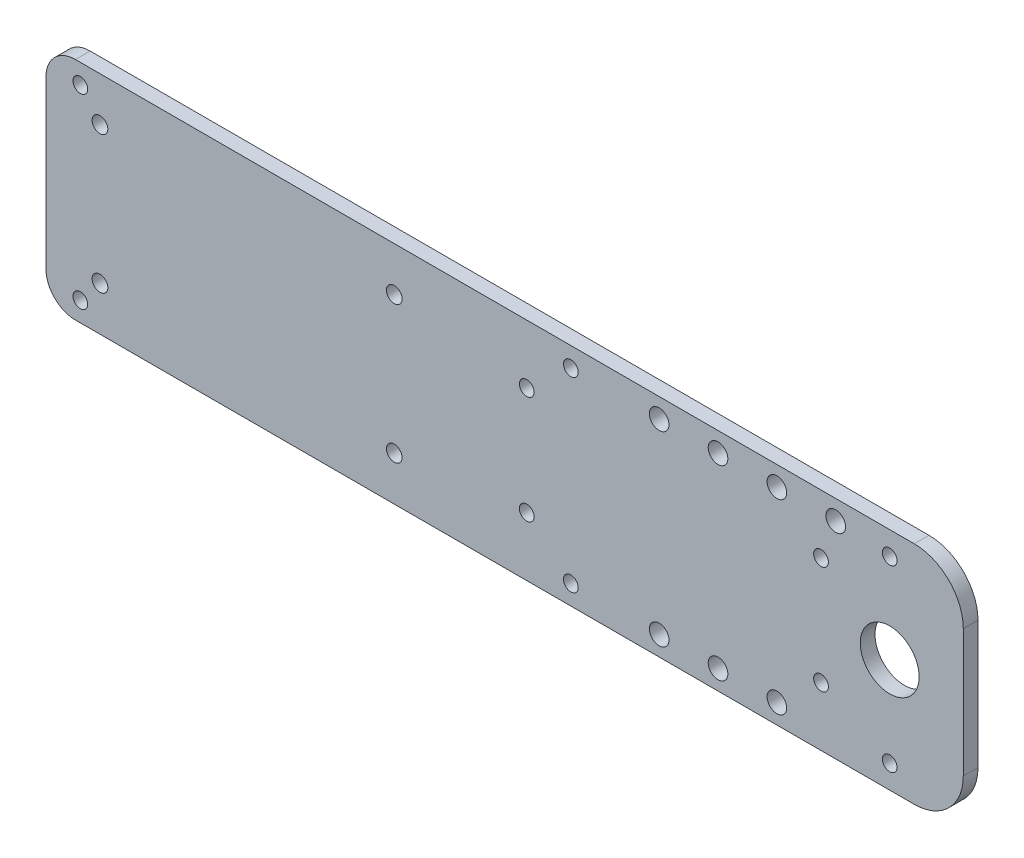
ISO-10303-21;
HEADER;
FILE_DESCRIPTION(('STEP AP214'),'2;1');
FILE_NAME('part.step','',(''),(''),'','','');
FILE_SCHEMA(('AUTOMOTIVE_DESIGN { 1 0 10303 214 1 1 1 1 }'));
ENDSEC;
DATA;
#1=APPLICATION_CONTEXT('core data for automotive mechanical design processes');
#2=APPLICATION_PROTOCOL_DEFINITION('international standard','automotive_design',2000,#1);
#3=PRODUCT_CONTEXT('',#1,'mechanical');
#4=PRODUCT('Part','Part','',(#3));
#5=PRODUCT_RELATED_PRODUCT_CATEGORY('part','',(#4));
#6=PRODUCT_DEFINITION_FORMATION('','',#4);
#7=PRODUCT_DEFINITION_CONTEXT('part definition',#1,'design');
#8=PRODUCT_DEFINITION('design','',#6,#7);
#9=PRODUCT_DEFINITION_SHAPE('','',#8);
#10=(LENGTH_UNIT() NAMED_UNIT(*) SI_UNIT(.MILLI.,.METRE.));
#11=(NAMED_UNIT(*) PLANE_ANGLE_UNIT() SI_UNIT($,.RADIAN.));
#12=(NAMED_UNIT(*) SI_UNIT($,.STERADIAN.) SOLID_ANGLE_UNIT());
#13=UNCERTAINTY_MEASURE_WITH_UNIT(LENGTH_MEASURE(1.E-05),#10,'distance_accuracy_value','');
#14=(GEOMETRIC_REPRESENTATION_CONTEXT(3) GLOBAL_UNCERTAINTY_ASSIGNED_CONTEXT((#13)) GLOBAL_UNIT_ASSIGNED_CONTEXT((#10,
#11,#12)) REPRESENTATION_CONTEXT('',''));
#15=CARTESIAN_POINT('',(0.,0.,0.));
#16=DIRECTION('',(0.,0.,1.));
#17=DIRECTION('',(1.,0.,0.));
#18=AXIS2_PLACEMENT_3D('',#15,#16,#17);
#19=CARTESIAN_POINT('',(0.,0.,3.));
#20=DIRECTION('',(0.,0.,1.));
#21=DIRECTION('',(1.,0.,0.));
#22=AXIS2_PLACEMENT_3D('',#19,#20,#21);
#23=PLANE('',#22);
#24=CARTESIAN_POINT('',(102.,11.,3.));
#25=DIRECTION('',(0.,0.,1.));
#26=DIRECTION('',(1.,0.,0.));
#27=AXIS2_PLACEMENT_3D('',#24,#25,#26);
#28=CIRCLE('',#27,1.5);
#29=CARTESIAN_POINT('',(103.5,11.,3.));
#30=VERTEX_POINT('',#29);
#31=EDGE_CURVE('E332',#30,#30,#28,.F.);
#32=ORIENTED_EDGE('',*,*,#31,.T.);
#33=EDGE_LOOP('',(#32));
#34=FACE_BOUND('',#33,.T.);
#35=CARTESIAN_POINT('',(69.,19.,3.));
#36=DIRECTION('',(0.,0.,1.));
#37=DIRECTION('',(1.,0.,0.));
#38=AXIS2_PLACEMENT_3D('',#35,#36,#37);
#39=CIRCLE('',#38,2.);
#40=CARTESIAN_POINT('',(71.,19.,3.));
#41=VERTEX_POINT('',#40);
#42=EDGE_CURVE('E344',#41,#41,#39,.T.);
#43=ORIENTED_EDGE('',*,*,#42,.F.);
#44=EDGE_LOOP('',(#43));
#45=FACE_BOUND('',#44,.T.);
#46=CARTESIAN_POINT('',(-49.,-19.,3.));
#47=DIRECTION('',(0.,0.,1.));
#48=DIRECTION('',(1.,0.,0.));
#49=AXIS2_PLACEMENT_3D('',#46,#47,#48);
#50=CIRCLE('',#49,1.5);
#51=CARTESIAN_POINT('',(-47.5,-19.,3.));
#52=VERTEX_POINT('',#51);
#53=EDGE_CURVE('E369',#52,#52,#50,.F.);
#54=ORIENTED_EDGE('',*,*,#53,.T.);
#55=EDGE_LOOP('',(#54));
#56=FACE_BOUND('',#55,.T.);
#57=CARTESIAN_POINT('',(69.,-19.,3.));
#58=DIRECTION('',(0.,0.,1.));
#59=DIRECTION('',(1.,0.,0.));
#60=AXIS2_PLACEMENT_3D('',#57,#58,#59);
#61=CIRCLE('',#60,2.);
#62=CARTESIAN_POINT('',(71.,-19.,3.));
#63=VERTEX_POINT('',#62);
#64=EDGE_CURVE('E345',#63,#63,#61,.T.);
#65=ORIENTED_EDGE('',*,*,#64,.F.);
#66=EDGE_LOOP('',(#65));
#67=FACE_BOUND('',#66,.T.);
#68=CARTESIAN_POINT('',(81.,-19.,3.));
#69=DIRECTION('',(0.,0.,1.));
#70=DIRECTION('',(1.,0.,0.));
#71=AXIS2_PLACEMENT_3D('',#68,#69,#70);
#72=CIRCLE('',#71,2.);
#73=CARTESIAN_POINT('',(83.,-19.,3.));
#74=VERTEX_POINT('',#73);
#75=EDGE_CURVE('E351',#74,#74,#72,.T.);
#76=ORIENTED_EDGE('',*,*,#75,.F.);
#77=EDGE_LOOP('',(#76));
#78=FACE_BOUND('',#77,.T.);
#79=CARTESIAN_POINT('',(81.,19.,3.));
#80=DIRECTION('',(0.,0.,1.));
#81=DIRECTION('',(1.,0.,0.));
#82=AXIS2_PLACEMENT_3D('',#79,#80,#81);
#83=CIRCLE('',#82,2.);
#84=CARTESIAN_POINT('',(83.,19.,3.));
#85=VERTEX_POINT('',#84);
#86=EDGE_CURVE('E331',#85,#85,#83,.T.);
#87=ORIENTED_EDGE('',*,*,#86,.F.);
#88=EDGE_LOOP('',(#87));
#89=FACE_BOUND('',#88,.T.);
#90=CARTESIAN_POINT('',(-49.,19.,3.));
#91=DIRECTION('',(0.,0.,1.));
#92=DIRECTION('',(1.,0.,0.));
#93=AXIS2_PLACEMENT_3D('',#90,#91,#92);
#94=CIRCLE('',#93,1.5);
#95=CARTESIAN_POINT('',(-47.5,19.,3.));
#96=VERTEX_POINT('',#95);
#97=EDGE_CURVE('E368',#96,#96,#94,.T.);
#98=ORIENTED_EDGE('',*,*,#97,.F.);
#99=EDGE_LOOP('',(#98));
#100=FACE_BOUND('',#99,.T.);
#101=DIRECTION('',(-1.,0.,0.));
#102=VECTOR('',#101,1.);
#103=CARTESIAN_POINT('',(0.,-23.,3.));
#104=LINE('',#103,#102);
#105=CARTESIAN_POINT('',(121.,-23.,3.));
#106=VERTEX_POINT('',#105);
#107=CARTESIAN_POINT('',(-50.,-23.,3.));
#108=VERTEX_POINT('',#107);
#109=EDGE_CURVE('E138',#106,#108,#104,.T.);
#110=ORIENTED_EDGE('',*,*,#109,.F.);
#111=CARTESIAN_POINT('',(121.,-13.,3.));
#112=DIRECTION('',(0.,0.,1.));
#113=DIRECTION('',(1.,0.,0.));
#114=AXIS2_PLACEMENT_3D('',#111,#112,#113);
#115=CIRCLE('',#114,10.);
#116=CARTESIAN_POINT('',(131.,-13.,3.));
#117=VERTEX_POINT('',#116);
#118=EDGE_CURVE('E165',#106,#117,#115,.T.);
#119=ORIENTED_EDGE('',*,*,#118,.T.);
#120=DIRECTION('',(0.,1.,0.));
#121=VECTOR('',#120,1.);
#122=CARTESIAN_POINT('',(131.,0.,3.));
#123=LINE('',#122,#121);
#124=CARTESIAN_POINT('',(131.,13.,3.));
#125=VERTEX_POINT('',#124);
#126=EDGE_CURVE('E179',#117,#125,#123,.T.);
#127=ORIENTED_EDGE('',*,*,#126,.T.);
#128=CARTESIAN_POINT('',(121.,13.,3.));
#129=DIRECTION('',(0.,0.,1.));
#130=DIRECTION('',(1.,0.,0.));
#131=AXIS2_PLACEMENT_3D('',#128,#129,#130);
#132=CIRCLE('',#131,10.);
#133=CARTESIAN_POINT('',(121.,23.,3.));
#134=VERTEX_POINT('',#133);
#135=EDGE_CURVE('E163',#125,#134,#132,.T.);
#136=ORIENTED_EDGE('',*,*,#135,.T.);
#137=DIRECTION('',(-1.,0.,0.));
#138=VECTOR('',#137,1.);
#139=CARTESIAN_POINT('',(0.,23.,3.));
#140=LINE('',#139,#138);
#141=CARTESIAN_POINT('',(-50.,23.,3.));
#142=VERTEX_POINT('',#141);
#143=EDGE_CURVE('E188',#134,#142,#140,.T.);
#144=ORIENTED_EDGE('',*,*,#143,.T.);
#145=CARTESIAN_POINT('',(-50.,17.,3.));
#146=DIRECTION('',(0.,0.,1.));
#147=DIRECTION('',(1.,0.,0.));
#148=AXIS2_PLACEMENT_3D('',#145,#146,#147);
#149=CIRCLE('',#148,6.);
#150=CARTESIAN_POINT('',(-56.,17.,3.));
#151=VERTEX_POINT('',#150);
#152=EDGE_CURVE('E154',#142,#151,#149,.T.);
#153=ORIENTED_EDGE('',*,*,#152,.T.);
#154=DIRECTION('',(0.,1.,0.));
#155=VECTOR('',#154,1.);
#156=CARTESIAN_POINT('',(-56.,0.,3.));
#157=LINE('',#156,#155);
#158=CARTESIAN_POINT('',(-56.,-17.,3.));
#159=VERTEX_POINT('',#158);
#160=EDGE_CURVE('E190',#159,#151,#157,.T.);
#161=ORIENTED_EDGE('',*,*,#160,.F.);
#162=CARTESIAN_POINT('',(-50.,-17.,3.));
#163=DIRECTION('',(0.,0.,1.));
#164=DIRECTION('',(1.,0.,0.));
#165=AXIS2_PLACEMENT_3D('',#162,#163,#164);
#166=CIRCLE('',#165,6.);
#167=EDGE_CURVE('E156',#159,#108,#166,.T.);
#168=ORIENTED_EDGE('',*,*,#167,.T.);
#169=EDGE_LOOP('',(#110,#119,#127,#136,#144,#153,#161,#168));
#170=FACE_BOUND('',#169,.T.);
#171=CARTESIAN_POINT('',(42.,11.,3.));
#172=DIRECTION('',(0.,0.,1.));
#173=DIRECTION('',(1.,0.,0.));
#174=AXIS2_PLACEMENT_3D('',#171,#172,#173);
#175=CIRCLE('',#174,1.50000000000001);
#176=CARTESIAN_POINT('',(43.5,11.,3.));
#177=VERTEX_POINT('',#176);
#178=EDGE_CURVE('E199',#177,#177,#175,.F.);
#179=ORIENTED_EDGE('',*,*,#178,.T.);
#180=EDGE_LOOP('',(#179));
#181=FACE_BOUND('',#180,.T.);
#182=CARTESIAN_POINT('',(15.,-14.,3.));
#183=DIRECTION('',(0.,0.,1.));
#184=DIRECTION('',(1.,0.,0.));
#185=AXIS2_PLACEMENT_3D('',#182,#183,#184);
#186=CIRCLE('',#185,1.6);
#187=CARTESIAN_POINT('',(16.6,-14.,3.));
#188=VERTEX_POINT('',#187);
#189=EDGE_CURVE('E202',#188,#188,#186,.T.);
#190=ORIENTED_EDGE('',*,*,#189,.F.);
#191=EDGE_LOOP('',(#190));
#192=FACE_BOUND('',#191,.T.);
#193=CARTESIAN_POINT('',(42.,-11.,3.));
#194=DIRECTION('',(0.,0.,1.));
#195=DIRECTION('',(1.,0.,0.));
#196=AXIS2_PLACEMENT_3D('',#193,#194,#195);
#197=CIRCLE('',#196,1.49999999999999);
#198=CARTESIAN_POINT('',(43.5,-11.,3.));
#199=VERTEX_POINT('',#198);
#200=EDGE_CURVE('E205',#199,#199,#197,.T.);
#201=ORIENTED_EDGE('',*,*,#200,.F.);
#202=EDGE_LOOP('',(#201));
#203=FACE_BOUND('',#202,.T.);
#204=CARTESIAN_POINT('',(-45.,14.,3.));
#205=DIRECTION('',(0.,0.,1.));
#206=DIRECTION('',(1.,0.,0.));
#207=AXIS2_PLACEMENT_3D('',#204,#205,#206);
#208=CIRCLE('',#207,1.6);
#209=CARTESIAN_POINT('',(-43.4,14.,3.));
#210=VERTEX_POINT('',#209);
#211=EDGE_CURVE('E208',#210,#210,#208,.T.);
#212=ORIENTED_EDGE('',*,*,#211,.F.);
#213=EDGE_LOOP('',(#212));
#214=FACE_BOUND('',#213,.T.);
#215=CARTESIAN_POINT('',(-45.,-14.,3.));
#216=DIRECTION('',(0.,0.,1.));
#217=DIRECTION('',(1.,0.,0.));
#218=AXIS2_PLACEMENT_3D('',#215,#216,#217);
#219=CIRCLE('',#218,1.6);
#220=CARTESIAN_POINT('',(-43.4,-14.,3.));
#221=VERTEX_POINT('',#220);
#222=EDGE_CURVE('E145',#221,#221,#219,.F.);
#223=ORIENTED_EDGE('',*,*,#222,.T.);
#224=EDGE_LOOP('',(#223));
#225=FACE_BOUND('',#224,.T.);
#226=CARTESIAN_POINT('',(15.,14.,3.));
#227=DIRECTION('',(0.,0.,1.));
#228=DIRECTION('',(1.,0.,0.));
#229=AXIS2_PLACEMENT_3D('',#226,#227,#228);
#230=CIRCLE('',#229,1.6);
#231=CARTESIAN_POINT('',(16.6,14.,3.));
#232=VERTEX_POINT('',#231);
#233=EDGE_CURVE('E140',#232,#232,#230,.F.);
#234=ORIENTED_EDGE('',*,*,#233,.T.);
#235=EDGE_LOOP('',(#234));
#236=FACE_BOUND('',#235,.T.);
#237=CARTESIAN_POINT('',(116.,-18.25,3.));
#238=DIRECTION('',(0.,0.,1.));
#239=DIRECTION('',(1.,0.,0.));
#240=AXIS2_PLACEMENT_3D('',#237,#238,#239);
#241=CIRCLE('',#240,1.5);
#242=CARTESIAN_POINT('',(117.5,-18.25,3.));
#243=VERTEX_POINT('',#242);
#244=EDGE_CURVE('E299',#243,#243,#241,.T.);
#245=ORIENTED_EDGE('',*,*,#244,.F.);
#246=EDGE_LOOP('',(#245));
#247=FACE_BOUND('',#246,.T.);
#248=CARTESIAN_POINT('',(116.,0.,3.));
#249=DIRECTION('',(0.,0.,1.));
#250=DIRECTION('',(1.,0.,0.));
#251=AXIS2_PLACEMENT_3D('',#248,#249,#250);
#252=CIRCLE('',#251,6.);
#253=CARTESIAN_POINT('',(122.,0.,3.));
#254=VERTEX_POINT('',#253);
#255=EDGE_CURVE('E303',#254,#254,#252,.T.);
#256=ORIENTED_EDGE('',*,*,#255,.F.);
#257=EDGE_LOOP('',(#256));
#258=FACE_BOUND('',#257,.T.);
#259=CARTESIAN_POINT('',(93.,-19.,3.));
#260=DIRECTION('',(0.,0.,1.));
#261=DIRECTION('',(1.,0.,0.));
#262=AXIS2_PLACEMENT_3D('',#259,#260,#261);
#263=CIRCLE('',#262,2.);
#264=CARTESIAN_POINT('',(95.,-19.,3.));
#265=VERTEX_POINT('',#264);
#266=EDGE_CURVE('E307',#265,#265,#263,.T.);
#267=ORIENTED_EDGE('',*,*,#266,.F.);
#268=EDGE_LOOP('',(#267));
#269=FACE_BOUND('',#268,.T.);
#270=CARTESIAN_POINT('',(105.,19.,3.));
#271=DIRECTION('',(0.,0.,1.));
#272=DIRECTION('',(1.,0.,0.));
#273=AXIS2_PLACEMENT_3D('',#270,#271,#272);
#274=CIRCLE('',#273,2.);
#275=CARTESIAN_POINT('',(107.,19.,3.));
#276=VERTEX_POINT('',#275);
#277=EDGE_CURVE('E311',#276,#276,#274,.T.);
#278=ORIENTED_EDGE('',*,*,#277,.F.);
#279=EDGE_LOOP('',(#278));
#280=FACE_BOUND('',#279,.T.);
#281=CARTESIAN_POINT('',(93.,19.,3.));
#282=DIRECTION('',(0.,0.,1.));
#283=DIRECTION('',(1.,0.,0.));
#284=AXIS2_PLACEMENT_3D('',#281,#282,#283);
#285=CIRCLE('',#284,2.);
#286=CARTESIAN_POINT('',(95.,19.,3.));
#287=VERTEX_POINT('',#286);
#288=EDGE_CURVE('E315',#287,#287,#285,.F.);
#289=ORIENTED_EDGE('',*,*,#288,.T.);
#290=EDGE_LOOP('',(#289));
#291=FACE_BOUND('',#290,.T.);
#292=CARTESIAN_POINT('',(116.,18.25,3.));
#293=DIRECTION('',(0.,0.,1.));
#294=DIRECTION('',(1.,0.,0.));
#295=AXIS2_PLACEMENT_3D('',#292,#293,#294);
#296=CIRCLE('',#295,1.50000000000001);
#297=CARTESIAN_POINT('',(117.5,18.25,3.));
#298=VERTEX_POINT('',#297);
#299=EDGE_CURVE('E182',#298,#298,#296,.F.);
#300=ORIENTED_EDGE('',*,*,#299,.T.);
#301=EDGE_LOOP('',(#300));
#302=FACE_BOUND('',#301,.T.);
#303=CARTESIAN_POINT('',(51.,19.,3.));
#304=DIRECTION('',(0.,0.,1.));
#305=DIRECTION('',(1.,0.,0.));
#306=AXIS2_PLACEMENT_3D('',#303,#304,#305);
#307=CIRCLE('',#306,1.5);
#308=CARTESIAN_POINT('',(52.5,19.,3.));
#309=VERTEX_POINT('',#308);
#310=EDGE_CURVE('E322',#309,#309,#307,.T.);
#311=ORIENTED_EDGE('',*,*,#310,.F.);
#312=EDGE_LOOP('',(#311));
#313=FACE_BOUND('',#312,.T.);
#314=CARTESIAN_POINT('',(51.,-19.,3.));
#315=DIRECTION('',(0.,0.,1.));
#316=DIRECTION('',(1.,0.,0.));
#317=AXIS2_PLACEMENT_3D('',#314,#315,#316);
#318=CIRCLE('',#317,1.5);
#319=CARTESIAN_POINT('',(52.5,-19.,3.));
#320=VERTEX_POINT('',#319);
#321=EDGE_CURVE('E326',#320,#320,#318,.F.);
#322=ORIENTED_EDGE('',*,*,#321,.T.);
#323=EDGE_LOOP('',(#322));
#324=FACE_BOUND('',#323,.T.);
#325=CARTESIAN_POINT('',(102.,-11.,3.));
#326=DIRECTION('',(0.,0.,1.));
#327=DIRECTION('',(1.,0.,0.));
#328=AXIS2_PLACEMENT_3D('',#325,#326,#327);
#329=CIRCLE('',#328,1.5);
#330=CARTESIAN_POINT('',(103.5,-11.,3.));
#331=VERTEX_POINT('',#330);
#332=EDGE_CURVE('E329',#331,#331,#329,.T.);
#333=ORIENTED_EDGE('',*,*,#332,.F.);
#334=EDGE_LOOP('',(#333));
#335=FACE_BOUND('',#334,.T.);
#336=ADVANCED_FACE('F48',(#34,#45,#56,#67,#78,#89,#100,#170,#181,#192,#203,#214,#225,#236,#247,
#258,#269,#280,#291,#302,#313,#324,#335),#23,.T.);
#337=CARTESIAN_POINT('',(0.,0.,0.));
#338=DIRECTION('',(0.,0.,1.));
#339=DIRECTION('',(1.,0.,0.));
#340=AXIS2_PLACEMENT_3D('',#337,#338,#339);
#341=PLANE('',#340);
#342=CARTESIAN_POINT('',(51.,-19.,0.));
#343=DIRECTION('',(0.,0.,1.));
#344=DIRECTION('',(1.,0.,0.));
#345=AXIS2_PLACEMENT_3D('',#342,#343,#344);
#346=CIRCLE('',#345,1.5);
#347=CARTESIAN_POINT('',(52.5,-19.,0.));
#348=VERTEX_POINT('',#347);
#349=EDGE_CURVE('E356',#348,#348,#346,.F.);
#350=ORIENTED_EDGE('',*,*,#349,.F.);
#351=EDGE_LOOP('',(#350));
#352=FACE_BOUND('',#351,.T.);
#353=CARTESIAN_POINT('',(-49.,-19.,0.));
#354=DIRECTION('',(0.,0.,1.));
#355=DIRECTION('',(1.,0.,0.));
#356=AXIS2_PLACEMENT_3D('',#353,#354,#355);
#357=CIRCLE('',#356,1.5);
#358=CARTESIAN_POINT('',(-47.5,-19.,0.));
#359=VERTEX_POINT('',#358);
#360=EDGE_CURVE('E365',#359,#359,#357,.F.);
#361=ORIENTED_EDGE('',*,*,#360,.F.);
#362=EDGE_LOOP('',(#361));
#363=FACE_BOUND('',#362,.T.);
#364=CARTESIAN_POINT('',(116.,18.25,0.));
#365=DIRECTION('',(0.,0.,1.));
#366=DIRECTION('',(1.,0.,0.));
#367=AXIS2_PLACEMENT_3D('',#364,#365,#366);
#368=CIRCLE('',#367,1.50000000000001);
#369=CARTESIAN_POINT('',(117.5,18.25,0.));
#370=VERTEX_POINT('',#369);
#371=EDGE_CURVE('E124',#370,#370,#368,.F.);
#372=ORIENTED_EDGE('',*,*,#371,.F.);
#373=EDGE_LOOP('',(#372));
#374=FACE_BOUND('',#373,.T.);
#375=CARTESIAN_POINT('',(93.,19.,0.));
#376=DIRECTION('',(0.,0.,1.));
#377=DIRECTION('',(1.,0.,0.));
#378=AXIS2_PLACEMENT_3D('',#375,#376,#377);
#379=CIRCLE('',#378,2.);
#380=CARTESIAN_POINT('',(95.,19.,0.));
#381=VERTEX_POINT('',#380);
#382=EDGE_CURVE('E392',#381,#381,#379,.F.);
#383=ORIENTED_EDGE('',*,*,#382,.F.);
#384=EDGE_LOOP('',(#383));
#385=FACE_BOUND('',#384,.T.);
#386=CARTESIAN_POINT('',(105.,19.,0.));
#387=DIRECTION('',(0.,0.,1.));
#388=DIRECTION('',(1.,0.,0.));
#389=AXIS2_PLACEMENT_3D('',#386,#387,#388);
#390=CIRCLE('',#389,2.);
#391=CARTESIAN_POINT('',(107.,19.,0.));
#392=VERTEX_POINT('',#391);
#393=EDGE_CURVE('E389',#392,#392,#390,.T.);
#394=ORIENTED_EDGE('',*,*,#393,.T.);
#395=EDGE_LOOP('',(#394));
#396=FACE_BOUND('',#395,.T.);
#397=CARTESIAN_POINT('',(93.,-19.,0.));
#398=DIRECTION('',(0.,0.,1.));
#399=DIRECTION('',(1.,0.,0.));
#400=AXIS2_PLACEMENT_3D('',#397,#398,#399);
#401=CIRCLE('',#400,2.);
#402=CARTESIAN_POINT('',(95.,-19.,0.));
#403=VERTEX_POINT('',#402);
#404=EDGE_CURVE('E386',#403,#403,#401,.T.);
#405=ORIENTED_EDGE('',*,*,#404,.T.);
#406=EDGE_LOOP('',(#405));
#407=FACE_BOUND('',#406,.T.);
#408=CARTESIAN_POINT('',(116.,0.,0.));
#409=DIRECTION('',(0.,0.,1.));
#410=DIRECTION('',(1.,0.,0.));
#411=AXIS2_PLACEMENT_3D('',#408,#409,#410);
#412=CIRCLE('',#411,6.);
#413=CARTESIAN_POINT('',(122.,0.,0.));
#414=VERTEX_POINT('',#413);
#415=EDGE_CURVE('E383',#414,#414,#412,.T.);
#416=ORIENTED_EDGE('',*,*,#415,.T.);
#417=EDGE_LOOP('',(#416));
#418=FACE_BOUND('',#417,.T.);
#419=CARTESIAN_POINT('',(116.,-18.25,0.));
#420=DIRECTION('',(0.,0.,1.));
#421=DIRECTION('',(1.,0.,0.));
#422=AXIS2_PLACEMENT_3D('',#419,#420,#421);
#423=CIRCLE('',#422,1.5);
#424=CARTESIAN_POINT('',(117.5,-18.25,0.));
#425=VERTEX_POINT('',#424);
#426=EDGE_CURVE('E181',#425,#425,#423,.T.);
#427=ORIENTED_EDGE('',*,*,#426,.T.);
#428=EDGE_LOOP('',(#427));
#429=FACE_BOUND('',#428,.T.);
#430=CARTESIAN_POINT('',(15.,14.,0.));
#431=DIRECTION('',(0.,0.,1.));
#432=DIRECTION('',(1.,0.,0.));
#433=AXIS2_PLACEMENT_3D('',#430,#431,#432);
#434=CIRCLE('',#433,1.6);
#435=CARTESIAN_POINT('',(16.6,14.,0.));
#436=VERTEX_POINT('',#435);
#437=EDGE_CURVE('E148',#436,#436,#434,.F.);
#438=ORIENTED_EDGE('',*,*,#437,.F.);
#439=EDGE_LOOP('',(#438));
#440=FACE_BOUND('',#439,.T.);
#441=CARTESIAN_POINT('',(-45.,-14.,0.));
#442=DIRECTION('',(0.,0.,1.));
#443=DIRECTION('',(1.,0.,0.));
#444=AXIS2_PLACEMENT_3D('',#441,#442,#443);
#445=CIRCLE('',#444,1.6);
#446=CARTESIAN_POINT('',(-43.4,-14.,0.));
#447=VERTEX_POINT('',#446);
#448=EDGE_CURVE('E193',#447,#447,#445,.F.);
#449=ORIENTED_EDGE('',*,*,#448,.F.);
#450=EDGE_LOOP('',(#449));
#451=FACE_BOUND('',#450,.T.);
#452=CARTESIAN_POINT('',(-45.,14.,0.));
#453=DIRECTION('',(0.,0.,1.));
#454=DIRECTION('',(1.,0.,0.));
#455=AXIS2_PLACEMENT_3D('',#452,#453,#454);
#456=CIRCLE('',#455,1.6);
#457=CARTESIAN_POINT('',(-43.4,14.,0.));
#458=VERTEX_POINT('',#457);
#459=EDGE_CURVE('E225',#458,#458,#456,.T.);
#460=ORIENTED_EDGE('',*,*,#459,.T.);
#461=EDGE_LOOP('',(#460));
#462=FACE_BOUND('',#461,.T.);
#463=CARTESIAN_POINT('',(42.,-11.,0.));
#464=DIRECTION('',(0.,0.,1.));
#465=DIRECTION('',(1.,0.,0.));
#466=AXIS2_PLACEMENT_3D('',#463,#464,#465);
#467=CIRCLE('',#466,1.49999999999999);
#468=CARTESIAN_POINT('',(43.5,-11.,0.));
#469=VERTEX_POINT('',#468);
#470=EDGE_CURVE('E222',#469,#469,#467,.T.);
#471=ORIENTED_EDGE('',*,*,#470,.T.);
#472=EDGE_LOOP('',(#471));
#473=FACE_BOUND('',#472,.T.);
#474=CARTESIAN_POINT('',(15.,-14.,0.));
#475=DIRECTION('',(0.,0.,1.));
#476=DIRECTION('',(1.,0.,0.));
#477=AXIS2_PLACEMENT_3D('',#474,#475,#476);
#478=CIRCLE('',#477,1.6);
#479=CARTESIAN_POINT('',(16.6,-14.,0.));
#480=VERTEX_POINT('',#479);
#481=EDGE_CURVE('E219',#480,#480,#478,.T.);
#482=ORIENTED_EDGE('',*,*,#481,.T.);
#483=EDGE_LOOP('',(#482));
#484=FACE_BOUND('',#483,.T.);
#485=CARTESIAN_POINT('',(42.,11.,0.));
#486=DIRECTION('',(0.,0.,1.));
#487=DIRECTION('',(1.,0.,0.));
#488=AXIS2_PLACEMENT_3D('',#485,#486,#487);
#489=CIRCLE('',#488,1.50000000000001);
#490=CARTESIAN_POINT('',(43.5,11.,0.));
#491=VERTEX_POINT('',#490);
#492=EDGE_CURVE('E216',#491,#491,#489,.F.);
#493=ORIENTED_EDGE('',*,*,#492,.F.);
#494=EDGE_LOOP('',(#493));
#495=FACE_BOUND('',#494,.T.);
#496=DIRECTION('',(0.,1.,0.));
#497=VECTOR('',#496,1.);
#498=CARTESIAN_POINT('',(131.,0.,0.));
#499=LINE('',#498,#497);
#500=CARTESIAN_POINT('',(131.,-13.,0.));
#501=VERTEX_POINT('',#500);
#502=CARTESIAN_POINT('',(131.,13.,0.));
#503=VERTEX_POINT('',#502);
#504=EDGE_CURVE('E176',#501,#503,#499,.T.);
#505=ORIENTED_EDGE('',*,*,#504,.F.);
#506=CARTESIAN_POINT('',(121.,-13.,0.));
#507=DIRECTION('',(0.,0.,1.));
#508=DIRECTION('',(1.,0.,0.));
#509=AXIS2_PLACEMENT_3D('',#506,#507,#508);
#510=CIRCLE('',#509,10.);
#511=CARTESIAN_POINT('',(121.,-23.,0.));
#512=VERTEX_POINT('',#511);
#513=EDGE_CURVE('E56',#501,#512,#510,.F.);
#514=ORIENTED_EDGE('',*,*,#513,.T.);
#515=DIRECTION('',(-1.,0.,0.));
#516=VECTOR('',#515,1.);
#517=CARTESIAN_POINT('',(0.,-23.,0.));
#518=LINE('',#517,#516);
#519=CARTESIAN_POINT('',(-50.,-23.,0.));
#520=VERTEX_POINT('',#519);
#521=EDGE_CURVE('E111',#512,#520,#518,.T.);
#522=ORIENTED_EDGE('',*,*,#521,.T.);
#523=CARTESIAN_POINT('',(-50.,-17.,0.));
#524=DIRECTION('',(0.,0.,1.));
#525=DIRECTION('',(1.,0.,0.));
#526=AXIS2_PLACEMENT_3D('',#523,#524,#525);
#527=CIRCLE('',#526,6.);
#528=CARTESIAN_POINT('',(-56.,-17.,0.));
#529=VERTEX_POINT('',#528);
#530=EDGE_CURVE('E116',#520,#529,#527,.F.);
#531=ORIENTED_EDGE('',*,*,#530,.T.);
#532=DIRECTION('',(0.,1.,0.));
#533=VECTOR('',#532,1.);
#534=CARTESIAN_POINT('',(-56.,0.,0.));
#535=LINE('',#534,#533);
#536=CARTESIAN_POINT('',(-56.,17.,0.));
#537=VERTEX_POINT('',#536);
#538=EDGE_CURVE('E214',#529,#537,#535,.T.);
#539=ORIENTED_EDGE('',*,*,#538,.T.);
#540=CARTESIAN_POINT('',(-50.,17.,0.));
#541=DIRECTION('',(0.,0.,1.));
#542=DIRECTION('',(1.,0.,0.));
#543=AXIS2_PLACEMENT_3D('',#540,#541,#542);
#544=CIRCLE('',#543,6.);
#545=CARTESIAN_POINT('',(-50.,23.,0.));
#546=VERTEX_POINT('',#545);
#547=EDGE_CURVE('E134',#537,#546,#544,.F.);
#548=ORIENTED_EDGE('',*,*,#547,.T.);
#549=DIRECTION('',(-1.,0.,0.));
#550=VECTOR('',#549,1.);
#551=CARTESIAN_POINT('',(0.,23.,0.));
#552=LINE('',#551,#550);
#553=CARTESIAN_POINT('',(121.,23.,0.));
#554=VERTEX_POINT('',#553);
#555=EDGE_CURVE('E123',#554,#546,#552,.T.);
#556=ORIENTED_EDGE('',*,*,#555,.F.);
#557=CARTESIAN_POINT('',(121.,13.,0.));
#558=DIRECTION('',(0.,0.,1.));
#559=DIRECTION('',(1.,0.,0.));
#560=AXIS2_PLACEMENT_3D('',#557,#558,#559);
#561=CIRCLE('',#560,10.);
#562=EDGE_CURVE('E68',#554,#503,#561,.F.);
#563=ORIENTED_EDGE('',*,*,#562,.T.);
#564=EDGE_LOOP('',(#505,#514,#522,#531,#539,#548,#556,#563));
#565=FACE_BOUND('',#564,.T.);
#566=CARTESIAN_POINT('',(-49.,19.,0.));
#567=DIRECTION('',(0.,0.,1.));
#568=DIRECTION('',(1.,0.,0.));
#569=AXIS2_PLACEMENT_3D('',#566,#567,#568);
#570=CIRCLE('',#569,1.5);
#571=CARTESIAN_POINT('',(-47.5,19.,0.));
#572=VERTEX_POINT('',#571);
#573=EDGE_CURVE('E376',#572,#572,#570,.T.);
#574=ORIENTED_EDGE('',*,*,#573,.T.);
#575=EDGE_LOOP('',(#574));
#576=FACE_BOUND('',#575,.T.);
#577=CARTESIAN_POINT('',(81.,19.,0.));
#578=DIRECTION('',(0.,0.,1.));
#579=DIRECTION('',(1.,0.,0.));
#580=AXIS2_PLACEMENT_3D('',#577,#578,#579);
#581=CIRCLE('',#580,2.);
#582=CARTESIAN_POINT('',(83.,19.,0.));
#583=VERTEX_POINT('',#582);
#584=EDGE_CURVE('E335',#583,#583,#581,.T.);
#585=ORIENTED_EDGE('',*,*,#584,.T.);
#586=EDGE_LOOP('',(#585));
#587=FACE_BOUND('',#586,.T.);
#588=CARTESIAN_POINT('',(81.,-19.,0.));
#589=DIRECTION('',(0.,0.,1.));
#590=DIRECTION('',(1.,0.,0.));
#591=AXIS2_PLACEMENT_3D('',#588,#589,#590);
#592=CIRCLE('',#591,2.);
#593=CARTESIAN_POINT('',(83.,-19.,0.));
#594=VERTEX_POINT('',#593);
#595=EDGE_CURVE('E348',#594,#594,#592,.T.);
#596=ORIENTED_EDGE('',*,*,#595,.T.);
#597=EDGE_LOOP('',(#596));
#598=FACE_BOUND('',#597,.T.);
#599=CARTESIAN_POINT('',(69.,-19.,0.));
#600=DIRECTION('',(0.,0.,1.));
#601=DIRECTION('',(1.,0.,0.));
#602=AXIS2_PLACEMENT_3D('',#599,#600,#601);
#603=CIRCLE('',#602,2.);
#604=CARTESIAN_POINT('',(71.,-19.,0.));
#605=VERTEX_POINT('',#604);
#606=EDGE_CURVE('E341',#605,#605,#603,.T.);
#607=ORIENTED_EDGE('',*,*,#606,.T.);
#608=EDGE_LOOP('',(#607));
#609=FACE_BOUND('',#608,.T.);
#610=CARTESIAN_POINT('',(51.,19.,0.));
#611=DIRECTION('',(0.,0.,1.));
#612=DIRECTION('',(1.,0.,0.));
#613=AXIS2_PLACEMENT_3D('',#610,#611,#612);
#614=CIRCLE('',#613,1.5);
#615=CARTESIAN_POINT('',(52.5,19.,0.));
#616=VERTEX_POINT('',#615);
#617=EDGE_CURVE('E372',#616,#616,#614,.T.);
#618=ORIENTED_EDGE('',*,*,#617,.T.);
#619=EDGE_LOOP('',(#618));
#620=FACE_BOUND('',#619,.T.);
#621=CARTESIAN_POINT('',(69.,19.,0.));
#622=DIRECTION('',(0.,0.,1.));
#623=DIRECTION('',(1.,0.,0.));
#624=AXIS2_PLACEMENT_3D('',#621,#622,#623);
#625=CIRCLE('',#624,2.);
#626=CARTESIAN_POINT('',(71.,19.,0.));
#627=VERTEX_POINT('',#626);
#628=EDGE_CURVE('E360',#627,#627,#625,.T.);
#629=ORIENTED_EDGE('',*,*,#628,.T.);
#630=EDGE_LOOP('',(#629));
#631=FACE_BOUND('',#630,.T.);
#632=CARTESIAN_POINT('',(102.,11.,0.));
#633=DIRECTION('',(0.,0.,1.));
#634=DIRECTION('',(1.,0.,0.));
#635=AXIS2_PLACEMENT_3D('',#632,#633,#634);
#636=CIRCLE('',#635,1.5);
#637=CARTESIAN_POINT('',(103.5,11.,0.));
#638=VERTEX_POINT('',#637);
#639=EDGE_CURVE('E484',#638,#638,#636,.T.);
#640=ORIENTED_EDGE('',*,*,#639,.T.);
#641=EDGE_LOOP('',(#640));
#642=FACE_BOUND('',#641,.T.);
#643=CARTESIAN_POINT('',(102.,-11.,0.));
#644=DIRECTION('',(0.,0.,-1.));
#645=DIRECTION('',(-1.,0.,0.));
#646=AXIS2_PLACEMENT_3D('',#643,#644,#645);
#647=CIRCLE('',#646,1.5);
#648=CARTESIAN_POINT('',(100.5,-11.,0.));
#649=VERTEX_POINT('',#648);
#650=EDGE_CURVE('E337',#649,#649,#647,.T.);
#651=ORIENTED_EDGE('',*,*,#650,.F.);
#652=EDGE_LOOP('',(#651));
#653=FACE_BOUND('',#652,.T.);
#654=ADVANCED_FACE('F113',(#352,#363,#374,#385,#396,#407,#418,#429,#440,#451,#462,#473,#484,
#495,#565,#576,#587,#598,#609,#620,#631,#642,#653),#341,.F.);
#655=CARTESIAN_POINT('',(0.,-23.,3.));
#656=DIRECTION('',(0.,-1.,0.));
#657=DIRECTION('',(1.,0.,0.));
#658=AXIS2_PLACEMENT_3D('',#655,#656,#657);
#659=PLANE('',#658);
#660=ORIENTED_EDGE('',*,*,#521,.F.);
#661=DIRECTION('',(0.,0.,1.));
#662=VECTOR('',#661,1.);
#663=CARTESIAN_POINT('',(121.,-23.,3.));
#664=LINE('',#663,#662);
#665=EDGE_CURVE('E161',#512,#106,#664,.T.);
#666=ORIENTED_EDGE('',*,*,#665,.T.);
#667=ORIENTED_EDGE('',*,*,#109,.T.);
#668=DIRECTION('',(0.,0.,-1.));
#669=VECTOR('',#668,1.);
#670=CARTESIAN_POINT('',(-50.,-23.,3.));
#671=LINE('',#670,#669);
#672=EDGE_CURVE('E131',#108,#520,#671,.T.);
#673=ORIENTED_EDGE('',*,*,#672,.T.);
#674=EDGE_LOOP('',(#660,#666,#667,#673));
#675=FACE_BOUND('',#674,.T.);
#676=ADVANCED_FACE('F136',(#675),#659,.T.);
#677=CARTESIAN_POINT('',(0.,23.,3.));
#678=DIRECTION('',(0.,-1.,0.));
#679=DIRECTION('',(1.,0.,0.));
#680=AXIS2_PLACEMENT_3D('',#677,#678,#679);
#681=PLANE('',#680);
#682=ORIENTED_EDGE('',*,*,#143,.F.);
#683=DIRECTION('',(0.,0.,1.));
#684=VECTOR('',#683,1.);
#685=CARTESIAN_POINT('',(121.,23.,0.));
#686=LINE('',#685,#684);
#687=EDGE_CURVE('E13',#134,#554,#686,.F.);
#688=ORIENTED_EDGE('',*,*,#687,.T.);
#689=ORIENTED_EDGE('',*,*,#555,.T.);
#690=DIRECTION('',(0.,0.,-1.));
#691=VECTOR('',#690,1.);
#692=CARTESIAN_POINT('',(-50.,23.,3.));
#693=LINE('',#692,#691);
#694=EDGE_CURVE('E158',#546,#142,#693,.F.);
#695=ORIENTED_EDGE('',*,*,#694,.T.);
#696=EDGE_LOOP('',(#682,#688,#689,#695));
#697=FACE_BOUND('',#696,.T.);
#698=ADVANCED_FACE('F277',(#697),#681,.F.);
#699=CARTESIAN_POINT('',(-45.,-14.,3.));
#700=DIRECTION('',(0.,0.,-1.));
#701=DIRECTION('',(-1.,0.,0.));
#702=AXIS2_PLACEMENT_3D('',#699,#700,#701);
#703=CYLINDRICAL_SURFACE('',#702,1.6);
#704=ORIENTED_EDGE('',*,*,#222,.F.);
#705=EDGE_LOOP('',(#704));
#706=FACE_BOUND('',#705,.T.);
#707=ORIENTED_EDGE('',*,*,#448,.T.);
#708=EDGE_LOOP('',(#707));
#709=FACE_BOUND('',#708,.T.);
#710=ADVANCED_FACE('F230',(#706,#709),#703,.F.);
#711=CARTESIAN_POINT('',(-45.,14.,3.));
#712=DIRECTION('',(0.,0.,-1.));
#713=DIRECTION('',(-1.,0.,0.));
#714=AXIS2_PLACEMENT_3D('',#711,#712,#713);
#715=CYLINDRICAL_SURFACE('',#714,1.6);
#716=ORIENTED_EDGE('',*,*,#211,.T.);
#717=EDGE_LOOP('',(#716));
#718=FACE_BOUND('',#717,.T.);
#719=ORIENTED_EDGE('',*,*,#459,.F.);
#720=EDGE_LOOP('',(#719));
#721=FACE_BOUND('',#720,.T.);
#722=ADVANCED_FACE('F276',(#718,#721),#715,.F.);
#723=CARTESIAN_POINT('',(42.,-11.,3.));
#724=DIRECTION('',(0.,0.,-1.));
#725=DIRECTION('',(-1.,0.,0.));
#726=AXIS2_PLACEMENT_3D('',#723,#724,#725);
#727=CYLINDRICAL_SURFACE('',#726,1.49999999999999);
#728=ORIENTED_EDGE('',*,*,#200,.T.);
#729=EDGE_LOOP('',(#728));
#730=FACE_BOUND('',#729,.T.);
#731=ORIENTED_EDGE('',*,*,#470,.F.);
#732=EDGE_LOOP('',(#731));
#733=FACE_BOUND('',#732,.T.);
#734=ADVANCED_FACE('F257',(#730,#733),#727,.F.);
#735=CARTESIAN_POINT('',(15.,-14.,3.));
#736=DIRECTION('',(0.,0.,-1.));
#737=DIRECTION('',(-1.,0.,0.));
#738=AXIS2_PLACEMENT_3D('',#735,#736,#737);
#739=CYLINDRICAL_SURFACE('',#738,1.6);
#740=ORIENTED_EDGE('',*,*,#189,.T.);
#741=EDGE_LOOP('',(#740));
#742=FACE_BOUND('',#741,.T.);
#743=ORIENTED_EDGE('',*,*,#481,.F.);
#744=EDGE_LOOP('',(#743));
#745=FACE_BOUND('',#744,.T.);
#746=ADVANCED_FACE('F247',(#742,#745),#739,.F.);
#747=CARTESIAN_POINT('',(42.,11.,3.));
#748=DIRECTION('',(0.,0.,-1.));
#749=DIRECTION('',(-1.,0.,0.));
#750=AXIS2_PLACEMENT_3D('',#747,#748,#749);
#751=CYLINDRICAL_SURFACE('',#750,1.50000000000001);
#752=ORIENTED_EDGE('',*,*,#178,.F.);
#753=EDGE_LOOP('',(#752));
#754=FACE_BOUND('',#753,.T.);
#755=ORIENTED_EDGE('',*,*,#492,.T.);
#756=EDGE_LOOP('',(#755));
#757=FACE_BOUND('',#756,.T.);
#758=ADVANCED_FACE('F244',(#754,#757),#751,.F.);
#759=CARTESIAN_POINT('',(-56.,0.,3.));
#760=DIRECTION('',(-1.,0.,0.));
#761=DIRECTION('',(0.,-1.,0.));
#762=AXIS2_PLACEMENT_3D('',#759,#760,#761);
#763=PLANE('',#762);
#764=ORIENTED_EDGE('',*,*,#538,.F.);
#765=DIRECTION('',(0.,0.,-1.));
#766=VECTOR('',#765,1.);
#767=CARTESIAN_POINT('',(-56.,-17.,3.));
#768=LINE('',#767,#766);
#769=EDGE_CURVE('E132',#529,#159,#768,.F.);
#770=ORIENTED_EDGE('',*,*,#769,.T.);
#771=ORIENTED_EDGE('',*,*,#160,.T.);
#772=DIRECTION('',(0.,0.,-1.));
#773=VECTOR('',#772,1.);
#774=CARTESIAN_POINT('',(-56.,17.,0.));
#775=LINE('',#774,#773);
#776=EDGE_CURVE('E133',#151,#537,#775,.T.);
#777=ORIENTED_EDGE('',*,*,#776,.T.);
#778=EDGE_LOOP('',(#764,#770,#771,#777));
#779=FACE_BOUND('',#778,.T.);
#780=ADVANCED_FACE('F246',(#779),#763,.T.);
#781=CARTESIAN_POINT('',(15.,14.,3.));
#782=DIRECTION('',(0.,0.,-1.));
#783=DIRECTION('',(-1.,0.,0.));
#784=AXIS2_PLACEMENT_3D('',#781,#782,#783);
#785=CYLINDRICAL_SURFACE('',#784,1.6);
#786=ORIENTED_EDGE('',*,*,#233,.F.);
#787=EDGE_LOOP('',(#786));
#788=FACE_BOUND('',#787,.T.);
#789=ORIENTED_EDGE('',*,*,#437,.T.);
#790=EDGE_LOOP('',(#789));
#791=FACE_BOUND('',#790,.T.);
#792=ADVANCED_FACE('F254',(#788,#791),#785,.F.);
#793=CARTESIAN_POINT('',(-50.,-17.,3.));
#794=DIRECTION('',(0.,0.,-1.));
#795=DIRECTION('',(-1.,0.,0.));
#796=AXIS2_PLACEMENT_3D('',#793,#794,#795);
#797=CYLINDRICAL_SURFACE('',#796,6.);
#798=ORIENTED_EDGE('',*,*,#167,.F.);
#799=ORIENTED_EDGE('',*,*,#769,.F.);
#800=ORIENTED_EDGE('',*,*,#530,.F.);
#801=ORIENTED_EDGE('',*,*,#672,.F.);
#802=EDGE_LOOP('',(#798,#799,#800,#801));
#803=FACE_BOUND('',#802,.T.);
#804=ADVANCED_FACE('F130',(#803),#797,.T.);
#805=CARTESIAN_POINT('',(-50.,17.,3.));
#806=DIRECTION('',(0.,0.,1.));
#807=DIRECTION('',(1.,0.,0.));
#808=AXIS2_PLACEMENT_3D('',#805,#806,#807);
#809=CYLINDRICAL_SURFACE('',#808,6.);
#810=ORIENTED_EDGE('',*,*,#152,.F.);
#811=ORIENTED_EDGE('',*,*,#694,.F.);
#812=ORIENTED_EDGE('',*,*,#547,.F.);
#813=ORIENTED_EDGE('',*,*,#776,.F.);
#814=EDGE_LOOP('',(#810,#811,#812,#813));
#815=FACE_BOUND('',#814,.T.);
#816=ADVANCED_FACE('F577',(#815),#809,.T.);
#817=CARTESIAN_POINT('',(131.,0.,0.));
#818=DIRECTION('',(1.,0.,0.));
#819=DIRECTION('',(0.,0.,-1.));
#820=AXIS2_PLACEMENT_3D('',#817,#818,#819);
#821=PLANE('',#820);
#822=ORIENTED_EDGE('',*,*,#126,.F.);
#823=DIRECTION('',(0.,0.,1.));
#824=VECTOR('',#823,1.);
#825=CARTESIAN_POINT('',(131.,-13.,0.));
#826=LINE('',#825,#824);
#827=EDGE_CURVE('E170',#117,#501,#826,.F.);
#828=ORIENTED_EDGE('',*,*,#827,.T.);
#829=ORIENTED_EDGE('',*,*,#504,.T.);
#830=DIRECTION('',(0.,0.,1.));
#831=VECTOR('',#830,1.);
#832=CARTESIAN_POINT('',(131.,13.,3.));
#833=LINE('',#832,#831);
#834=EDGE_CURVE('E167',#503,#125,#833,.T.);
#835=ORIENTED_EDGE('',*,*,#834,.T.);
#836=EDGE_LOOP('',(#822,#828,#829,#835));
#837=FACE_BOUND('',#836,.T.);
#838=ADVANCED_FACE('F175',(#837),#821,.T.);
#839=CARTESIAN_POINT('',(93.,19.,0.));
#840=DIRECTION('',(0.,0.,1.));
#841=DIRECTION('',(1.,0.,0.));
#842=AXIS2_PLACEMENT_3D('',#839,#840,#841);
#843=CYLINDRICAL_SURFACE('',#842,2.);
#844=ORIENTED_EDGE('',*,*,#382,.T.);
#845=EDGE_LOOP('',(#844));
#846=FACE_BOUND('',#845,.T.);
#847=ORIENTED_EDGE('',*,*,#288,.F.);
#848=EDGE_LOOP('',(#847));
#849=FACE_BOUND('',#848,.T.);
#850=ADVANCED_FACE('F405',(#846,#849),#843,.F.);
#851=CARTESIAN_POINT('',(105.,19.,0.));
#852=DIRECTION('',(0.,0.,1.));
#853=DIRECTION('',(1.,0.,0.));
#854=AXIS2_PLACEMENT_3D('',#851,#852,#853);
#855=CYLINDRICAL_SURFACE('',#854,2.);
#856=ORIENTED_EDGE('',*,*,#393,.F.);
#857=EDGE_LOOP('',(#856));
#858=FACE_BOUND('',#857,.T.);
#859=ORIENTED_EDGE('',*,*,#277,.T.);
#860=EDGE_LOOP('',(#859));
#861=FACE_BOUND('',#860,.T.);
#862=ADVANCED_FACE('F402',(#858,#861),#855,.F.);
#863=CARTESIAN_POINT('',(93.,-19.,0.));
#864=DIRECTION('',(0.,0.,1.));
#865=DIRECTION('',(1.,0.,0.));
#866=AXIS2_PLACEMENT_3D('',#863,#864,#865);
#867=CYLINDRICAL_SURFACE('',#866,2.);
#868=ORIENTED_EDGE('',*,*,#404,.F.);
#869=EDGE_LOOP('',(#868));
#870=FACE_BOUND('',#869,.T.);
#871=ORIENTED_EDGE('',*,*,#266,.T.);
#872=EDGE_LOOP('',(#871));
#873=FACE_BOUND('',#872,.T.);
#874=ADVANCED_FACE('F404',(#870,#873),#867,.F.);
#875=CARTESIAN_POINT('',(116.,0.,0.));
#876=DIRECTION('',(0.,0.,1.));
#877=DIRECTION('',(1.,0.,0.));
#878=AXIS2_PLACEMENT_3D('',#875,#876,#877);
#879=CYLINDRICAL_SURFACE('',#878,6.);
#880=ORIENTED_EDGE('',*,*,#415,.F.);
#881=EDGE_LOOP('',(#880));
#882=FACE_BOUND('',#881,.T.);
#883=ORIENTED_EDGE('',*,*,#255,.T.);
#884=EDGE_LOOP('',(#883));
#885=FACE_BOUND('',#884,.T.);
#886=ADVANCED_FACE('F412',(#882,#885),#879,.F.);
#887=CARTESIAN_POINT('',(116.,-18.25,0.));
#888=DIRECTION('',(0.,0.,1.));
#889=DIRECTION('',(1.,0.,0.));
#890=AXIS2_PLACEMENT_3D('',#887,#888,#889);
#891=CYLINDRICAL_SURFACE('',#890,1.5);
#892=ORIENTED_EDGE('',*,*,#426,.F.);
#893=EDGE_LOOP('',(#892));
#894=FACE_BOUND('',#893,.T.);
#895=ORIENTED_EDGE('',*,*,#244,.T.);
#896=EDGE_LOOP('',(#895));
#897=FACE_BOUND('',#896,.T.);
#898=ADVANCED_FACE('F421',(#894,#897),#891,.F.);
#899=CARTESIAN_POINT('',(116.,18.25,0.));
#900=DIRECTION('',(0.,0.,1.));
#901=DIRECTION('',(1.,0.,0.));
#902=AXIS2_PLACEMENT_3D('',#899,#900,#901);
#903=CYLINDRICAL_SURFACE('',#902,1.50000000000001);
#904=ORIENTED_EDGE('',*,*,#371,.T.);
#905=EDGE_LOOP('',(#904));
#906=FACE_BOUND('',#905,.T.);
#907=ORIENTED_EDGE('',*,*,#299,.F.);
#908=EDGE_LOOP('',(#907));
#909=FACE_BOUND('',#908,.T.);
#910=ADVANCED_FACE('F424',(#906,#909),#903,.F.);
#911=CARTESIAN_POINT('',(-49.,19.,0.));
#912=DIRECTION('',(0.,0.,1.));
#913=DIRECTION('',(1.,0.,0.));
#914=AXIS2_PLACEMENT_3D('',#911,#912,#913);
#915=CYLINDRICAL_SURFACE('',#914,1.5);
#916=ORIENTED_EDGE('',*,*,#573,.F.);
#917=EDGE_LOOP('',(#916));
#918=FACE_BOUND('',#917,.T.);
#919=ORIENTED_EDGE('',*,*,#97,.T.);
#920=EDGE_LOOP('',(#919));
#921=FACE_BOUND('',#920,.T.);
#922=ADVANCED_FACE('F429',(#918,#921),#915,.F.);
#923=CARTESIAN_POINT('',(81.,19.,0.));
#924=DIRECTION('',(0.,0.,1.));
#925=DIRECTION('',(1.,0.,0.));
#926=AXIS2_PLACEMENT_3D('',#923,#924,#925);
#927=CYLINDRICAL_SURFACE('',#926,2.);
#928=ORIENTED_EDGE('',*,*,#584,.F.);
#929=EDGE_LOOP('',(#928));
#930=FACE_BOUND('',#929,.T.);
#931=ORIENTED_EDGE('',*,*,#86,.T.);
#932=EDGE_LOOP('',(#931));
#933=FACE_BOUND('',#932,.T.);
#934=ADVANCED_FACE('F440',(#930,#933),#927,.F.);
#935=CARTESIAN_POINT('',(81.,-19.,0.));
#936=DIRECTION('',(0.,0.,1.));
#937=DIRECTION('',(1.,0.,0.));
#938=AXIS2_PLACEMENT_3D('',#935,#936,#937);
#939=CYLINDRICAL_SURFACE('',#938,2.);
#940=ORIENTED_EDGE('',*,*,#595,.F.);
#941=EDGE_LOOP('',(#940));
#942=FACE_BOUND('',#941,.T.);
#943=ORIENTED_EDGE('',*,*,#75,.T.);
#944=EDGE_LOOP('',(#943));
#945=FACE_BOUND('',#944,.T.);
#946=ADVANCED_FACE('F464',(#942,#945),#939,.F.);
#947=CARTESIAN_POINT('',(69.,-19.,0.));
#948=DIRECTION('',(0.,0.,1.));
#949=DIRECTION('',(1.,0.,0.));
#950=AXIS2_PLACEMENT_3D('',#947,#948,#949);
#951=CYLINDRICAL_SURFACE('',#950,2.);
#952=ORIENTED_EDGE('',*,*,#606,.F.);
#953=EDGE_LOOP('',(#952));
#954=FACE_BOUND('',#953,.T.);
#955=ORIENTED_EDGE('',*,*,#64,.T.);
#956=EDGE_LOOP('',(#955));
#957=FACE_BOUND('',#956,.T.);
#958=ADVANCED_FACE('F453',(#954,#957),#951,.F.);
#959=CARTESIAN_POINT('',(-49.,-19.,0.));
#960=DIRECTION('',(0.,0.,1.));
#961=DIRECTION('',(1.,0.,0.));
#962=AXIS2_PLACEMENT_3D('',#959,#960,#961);
#963=CYLINDRICAL_SURFACE('',#962,1.5);
#964=ORIENTED_EDGE('',*,*,#360,.T.);
#965=EDGE_LOOP('',(#964));
#966=FACE_BOUND('',#965,.T.);
#967=ORIENTED_EDGE('',*,*,#53,.F.);
#968=EDGE_LOOP('',(#967));
#969=FACE_BOUND('',#968,.T.);
#970=ADVANCED_FACE('F449',(#966,#969),#963,.F.);
#971=CARTESIAN_POINT('',(51.,19.,0.));
#972=DIRECTION('',(0.,0.,1.));
#973=DIRECTION('',(1.,0.,0.));
#974=AXIS2_PLACEMENT_3D('',#971,#972,#973);
#975=CYLINDRICAL_SURFACE('',#974,1.5);
#976=ORIENTED_EDGE('',*,*,#617,.F.);
#977=EDGE_LOOP('',(#976));
#978=FACE_BOUND('',#977,.T.);
#979=ORIENTED_EDGE('',*,*,#310,.T.);
#980=EDGE_LOOP('',(#979));
#981=FACE_BOUND('',#980,.T.);
#982=ADVANCED_FACE('F445',(#978,#981),#975,.F.);
#983=CARTESIAN_POINT('',(51.,-19.,0.));
#984=DIRECTION('',(0.,0.,1.));
#985=DIRECTION('',(1.,0.,0.));
#986=AXIS2_PLACEMENT_3D('',#983,#984,#985);
#987=CYLINDRICAL_SURFACE('',#986,1.5);
#988=ORIENTED_EDGE('',*,*,#349,.T.);
#989=EDGE_LOOP('',(#988));
#990=FACE_BOUND('',#989,.T.);
#991=ORIENTED_EDGE('',*,*,#321,.F.);
#992=EDGE_LOOP('',(#991));
#993=FACE_BOUND('',#992,.T.);
#994=ADVANCED_FACE('F448',(#990,#993),#987,.F.);
#995=CARTESIAN_POINT('',(69.,19.,0.));
#996=DIRECTION('',(0.,0.,1.));
#997=DIRECTION('',(1.,0.,0.));
#998=AXIS2_PLACEMENT_3D('',#995,#996,#997);
#999=CYLINDRICAL_SURFACE('',#998,2.);
#1000=ORIENTED_EDGE('',*,*,#628,.F.);
#1001=EDGE_LOOP('',(#1000));
#1002=FACE_BOUND('',#1001,.T.);
#1003=ORIENTED_EDGE('',*,*,#42,.T.);
#1004=EDGE_LOOP('',(#1003));
#1005=FACE_BOUND('',#1004,.T.);
#1006=ADVANCED_FACE('F455',(#1002,#1005),#999,.F.);
#1007=CARTESIAN_POINT('',(121.,-13.,3.));
#1008=DIRECTION('',(0.,0.,1.));
#1009=DIRECTION('',(1.,0.,0.));
#1010=AXIS2_PLACEMENT_3D('',#1007,#1008,#1009);
#1011=CYLINDRICAL_SURFACE('',#1010,10.);
#1012=ORIENTED_EDGE('',*,*,#513,.F.);
#1013=ORIENTED_EDGE('',*,*,#827,.F.);
#1014=ORIENTED_EDGE('',*,*,#118,.F.);
#1015=ORIENTED_EDGE('',*,*,#665,.F.);
#1016=EDGE_LOOP('',(#1012,#1013,#1014,#1015));
#1017=FACE_BOUND('',#1016,.T.);
#1018=ADVANCED_FACE('F184',(#1017),#1011,.T.);
#1019=CARTESIAN_POINT('',(121.,13.,0.));
#1020=DIRECTION('',(0.,0.,-1.));
#1021=DIRECTION('',(-1.,0.,0.));
#1022=AXIS2_PLACEMENT_3D('',#1019,#1020,#1021);
#1023=CYLINDRICAL_SURFACE('',#1022,10.);
#1024=ORIENTED_EDGE('',*,*,#562,.F.);
#1025=ORIENTED_EDGE('',*,*,#687,.F.);
#1026=ORIENTED_EDGE('',*,*,#135,.F.);
#1027=ORIENTED_EDGE('',*,*,#834,.F.);
#1028=EDGE_LOOP('',(#1024,#1025,#1026,#1027));
#1029=FACE_BOUND('',#1028,.T.);
#1030=ADVANCED_FACE('F50',(#1029),#1023,.T.);
#1031=CARTESIAN_POINT('',(102.,11.,10.));
#1032=DIRECTION('',(0.,0.,-1.));
#1033=DIRECTION('',(-1.,0.,0.));
#1034=AXIS2_PLACEMENT_3D('',#1031,#1032,#1033);
#1035=CYLINDRICAL_SURFACE('',#1034,1.5);
#1036=ORIENTED_EDGE('',*,*,#31,.F.);
#1037=EDGE_LOOP('',(#1036));
#1038=FACE_BOUND('',#1037,.T.);
#1039=ORIENTED_EDGE('',*,*,#639,.F.);
#1040=EDGE_LOOP('',(#1039));
#1041=FACE_BOUND('',#1040,.T.);
#1042=ADVANCED_FACE('F472',(#1038,#1041),#1035,.F.);
#1043=CARTESIAN_POINT('',(102.,-11.,10.));
#1044=DIRECTION('',(0.,0.,-1.));
#1045=DIRECTION('',(-1.,0.,0.));
#1046=AXIS2_PLACEMENT_3D('',#1043,#1044,#1045);
#1047=CYLINDRICAL_SURFACE('',#1046,1.5);
#1048=ORIENTED_EDGE('',*,*,#332,.T.);
#1049=EDGE_LOOP('',(#1048));
#1050=FACE_BOUND('',#1049,.T.);
#1051=ORIENTED_EDGE('',*,*,#650,.T.);
#1052=EDGE_LOOP('',(#1051));
#1053=FACE_BOUND('',#1052,.T.);
#1054=ADVANCED_FACE('F475',(#1050,#1053),#1047,.F.);
#1055=CLOSED_SHELL('',(#336,#654,#676,#698,#710,#722,#734,#746,#758,#780,#792,#804,#816,#838,
#850,#862,#874,#886,#898,#910,#922,#934,#946,#958,#970,#982,#994,#1006,#1018,#1030,#1042,#1054));
#1056=MANIFOLD_SOLID_BREP('B2',#1055);
#1057=ADVANCED_BREP_SHAPE_REPRESENTATION('',(#18,#1056),#14);
#1058=SHAPE_DEFINITION_REPRESENTATION(#9,#1057);
ENDSEC;
END-ISO-10303-21;
